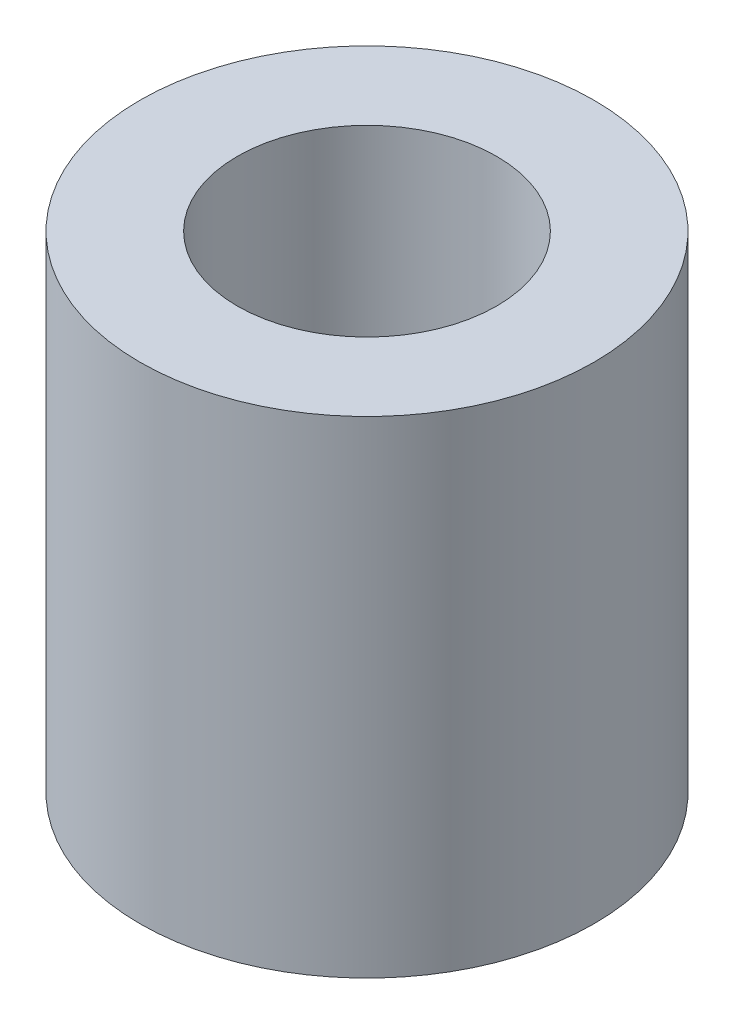
ISO-10303-21;
HEADER;
FILE_DESCRIPTION(('STEP AP214'),'2;1');
FILE_NAME('part.step','',(''),(''),'','','');
FILE_SCHEMA(('AUTOMOTIVE_DESIGN { 1 0 10303 214 1 1 1 1 }'));
ENDSEC;
DATA;
#1=APPLICATION_CONTEXT('core data for automotive mechanical design processes');
#2=APPLICATION_PROTOCOL_DEFINITION('international standard','automotive_design',2000,#1);
#3=PRODUCT_CONTEXT('',#1,'mechanical');
#4=PRODUCT('Part','Part','',(#3));
#5=PRODUCT_RELATED_PRODUCT_CATEGORY('part','',(#4));
#6=PRODUCT_DEFINITION_FORMATION('','',#4);
#7=PRODUCT_DEFINITION_CONTEXT('part definition',#1,'design');
#8=PRODUCT_DEFINITION('design','',#6,#7);
#9=PRODUCT_DEFINITION_SHAPE('','',#8);
#10=(LENGTH_UNIT() NAMED_UNIT(*) SI_UNIT(.MILLI.,.METRE.));
#11=(NAMED_UNIT(*) PLANE_ANGLE_UNIT() SI_UNIT($,.RADIAN.));
#12=(NAMED_UNIT(*) SI_UNIT($,.STERADIAN.) SOLID_ANGLE_UNIT());
#13=UNCERTAINTY_MEASURE_WITH_UNIT(LENGTH_MEASURE(1.E-05),#10,'distance_accuracy_value','');
#14=(GEOMETRIC_REPRESENTATION_CONTEXT(3) GLOBAL_UNCERTAINTY_ASSIGNED_CONTEXT((#13)) GLOBAL_UNIT_ASSIGNED_CONTEXT((#10,
#11,#12)) REPRESENTATION_CONTEXT('',''));
#15=CARTESIAN_POINT('',(0.,0.,0.));
#16=DIRECTION('',(0.,0.,1.));
#17=DIRECTION('',(1.,0.,0.));
#18=AXIS2_PLACEMENT_3D('',#15,#16,#17);
#19=CARTESIAN_POINT('',(0.,15.,0.));
#20=DIRECTION('',(0.,1.,0.));
#21=DIRECTION('',(0.,0.,1.));
#22=AXIS2_PLACEMENT_3D('',#19,#20,#21);
#23=PLANE('',#22);
#24=CARTESIAN_POINT('',(0.,15.,0.));
#25=DIRECTION('',(0.,1.,0.));
#26=DIRECTION('',(0.,0.,1.));
#27=AXIS2_PLACEMENT_3D('',#24,#25,#26);
#28=CIRCLE('',#27,7.);
#29=CARTESIAN_POINT('',(0.,15.,7.));
#30=VERTEX_POINT('',#29);
#31=EDGE_CURVE('E10',#30,#30,#28,.T.);
#32=ORIENTED_EDGE('',*,*,#31,.T.);
#33=EDGE_LOOP('',(#32));
#34=FACE_BOUND('',#33,.T.);
#35=CARTESIAN_POINT('',(0.,15.,0.));
#36=DIRECTION('',(0.,1.,0.));
#37=DIRECTION('',(0.,0.,1.));
#38=AXIS2_PLACEMENT_3D('',#35,#36,#37);
#39=CIRCLE('',#38,4.);
#40=CARTESIAN_POINT('',(0.,15.,4.));
#41=VERTEX_POINT('',#40);
#42=EDGE_CURVE('E42',#41,#41,#39,.T.);
#43=ORIENTED_EDGE('',*,*,#42,.F.);
#44=EDGE_LOOP('',(#43));
#45=FACE_BOUND('',#44,.T.);
#46=ADVANCED_FACE('F31',(#34,#45),#23,.T.);
#47=CARTESIAN_POINT('',(0.,0.,0.));
#48=DIRECTION('',(0.,1.,0.));
#49=DIRECTION('',(0.,0.,1.));
#50=AXIS2_PLACEMENT_3D('',#47,#48,#49);
#51=PLANE('',#50);
#52=CARTESIAN_POINT('',(0.,0.,0.));
#53=DIRECTION('',(0.,1.,0.));
#54=DIRECTION('',(0.,0.,1.));
#55=AXIS2_PLACEMENT_3D('',#52,#53,#54);
#56=CIRCLE('',#55,7.);
#57=CARTESIAN_POINT('',(0.,0.,7.));
#58=VERTEX_POINT('',#57);
#59=EDGE_CURVE('E35',#58,#58,#56,.T.);
#60=ORIENTED_EDGE('',*,*,#59,.F.);
#61=EDGE_LOOP('',(#60));
#62=FACE_BOUND('',#61,.T.);
#63=CARTESIAN_POINT('',(0.,0.,0.));
#64=DIRECTION('',(0.,1.,0.));
#65=DIRECTION('',(0.,0.,1.));
#66=AXIS2_PLACEMENT_3D('',#63,#64,#65);
#67=CIRCLE('',#66,4.);
#68=CARTESIAN_POINT('',(0.,0.,4.));
#69=VERTEX_POINT('',#68);
#70=EDGE_CURVE('E44',#69,#69,#67,.T.);
#71=ORIENTED_EDGE('',*,*,#70,.T.);
#72=EDGE_LOOP('',(#71));
#73=FACE_BOUND('',#72,.T.);
#74=ADVANCED_FACE('F54',(#62,#73),#51,.F.);
#75=CARTESIAN_POINT('',(0.,15.,0.));
#76=DIRECTION('',(0.,-1.,0.));
#77=DIRECTION('',(0.,0.,-1.));
#78=AXIS2_PLACEMENT_3D('',#75,#76,#77);
#79=CYLINDRICAL_SURFACE('',#78,7.);
#80=ORIENTED_EDGE('',*,*,#31,.F.);
#81=EDGE_LOOP('',(#80));
#82=FACE_BOUND('',#81,.T.);
#83=ORIENTED_EDGE('',*,*,#59,.T.);
#84=EDGE_LOOP('',(#83));
#85=FACE_BOUND('',#84,.T.);
#86=ADVANCED_FACE('F33',(#82,#85),#79,.T.);
#87=CARTESIAN_POINT('',(0.,15.,0.));
#88=DIRECTION('',(0.,-1.,0.));
#89=DIRECTION('',(0.,0.,-1.));
#90=AXIS2_PLACEMENT_3D('',#87,#88,#89);
#91=CYLINDRICAL_SURFACE('',#90,4.);
#92=ORIENTED_EDGE('',*,*,#42,.T.);
#93=EDGE_LOOP('',(#92));
#94=FACE_BOUND('',#93,.T.);
#95=ORIENTED_EDGE('',*,*,#70,.F.);
#96=EDGE_LOOP('',(#95));
#97=FACE_BOUND('',#96,.T.);
#98=ADVANCED_FACE('F50',(#94,#97),#91,.F.);
#99=CLOSED_SHELL('',(#46,#74,#86,#98));
#100=MANIFOLD_SOLID_BREP('B2',#99);
#101=ADVANCED_BREP_SHAPE_REPRESENTATION('',(#18,#100),#14);
#102=SHAPE_DEFINITION_REPRESENTATION(#9,#101);
ENDSEC;
END-ISO-10303-21;
